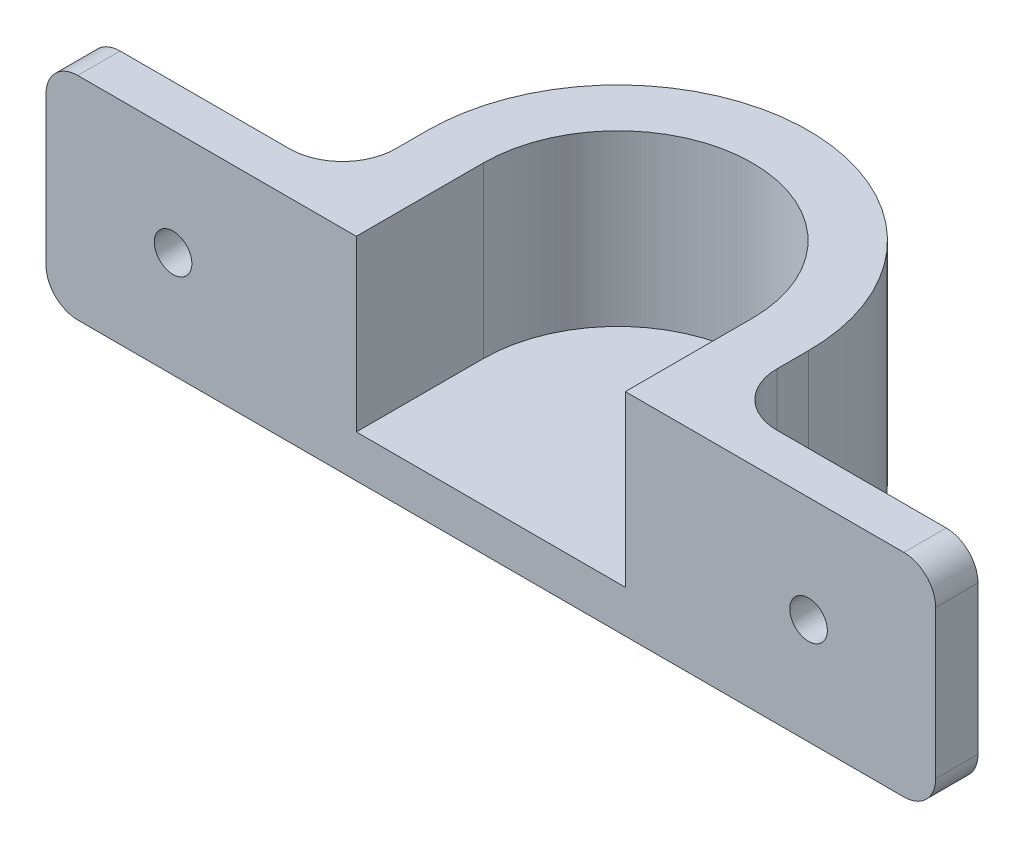
ISO-10303-21;
HEADER;
FILE_DESCRIPTION(('STEP AP214'),'2;1');
FILE_NAME('part.step','',(''),(''),'','','');
FILE_SCHEMA(('AUTOMOTIVE_DESIGN { 1 0 10303 214 1 1 1 1 }'));
ENDSEC;
DATA;
#1=APPLICATION_CONTEXT('core data for automotive mechanical design processes');
#2=APPLICATION_PROTOCOL_DEFINITION('international standard','automotive_design',2000,#1);
#3=PRODUCT_CONTEXT('',#1,'mechanical');
#4=PRODUCT('Part','Part','',(#3));
#5=PRODUCT_RELATED_PRODUCT_CATEGORY('part','',(#4));
#6=PRODUCT_DEFINITION_FORMATION('','',#4);
#7=PRODUCT_DEFINITION_CONTEXT('part definition',#1,'design');
#8=PRODUCT_DEFINITION('design','',#6,#7);
#9=PRODUCT_DEFINITION_SHAPE('','',#8);
#10=(LENGTH_UNIT() NAMED_UNIT(*) SI_UNIT(.MILLI.,.METRE.));
#11=(NAMED_UNIT(*) PLANE_ANGLE_UNIT() SI_UNIT($,.RADIAN.));
#12=(NAMED_UNIT(*) SI_UNIT($,.STERADIAN.) SOLID_ANGLE_UNIT());
#13=UNCERTAINTY_MEASURE_WITH_UNIT(LENGTH_MEASURE(1.E-05),#10,'distance_accuracy_value','');
#14=(GEOMETRIC_REPRESENTATION_CONTEXT(3) GLOBAL_UNCERTAINTY_ASSIGNED_CONTEXT((#13)) GLOBAL_UNIT_ASSIGNED_CONTEXT((#10,
#11,#12)) REPRESENTATION_CONTEXT('',''));
#15=CARTESIAN_POINT('',(0.,0.,0.));
#16=DIRECTION('',(0.,0.,1.));
#17=DIRECTION('',(1.,0.,0.));
#18=AXIS2_PLACEMENT_3D('',#15,#16,#17);
#19=CARTESIAN_POINT('',(29.3,20.,-12.));
#20=DIRECTION('',(-1.,0.,0.));
#21=DIRECTION('',(0.,0.,1.));
#22=AXIS2_PLACEMENT_3D('',#19,#20,#21);
#23=PLANE('',#22);
#24=DIRECTION('',(0.,0.,-1.));
#25=VECTOR('',#24,1.);
#26=CARTESIAN_POINT('',(29.3,4.,0.));
#27=LINE('',#26,#25);
#28=CARTESIAN_POINT('',(29.3,4.,0.));
#29=VERTEX_POINT('',#28);
#30=CARTESIAN_POINT('',(29.3,4.,-12.));
#31=VERTEX_POINT('',#30);
#32=EDGE_CURVE('E65',#29,#31,#27,.T.);
#33=ORIENTED_EDGE('',*,*,#32,.T.);
#34=DIRECTION('',(0.,-1.,0.));
#35=VECTOR('',#34,1.);
#36=CARTESIAN_POINT('',(29.3,20.,-12.));
#37=LINE('',#36,#35);
#38=CARTESIAN_POINT('',(29.3,20.,-12.));
#39=VERTEX_POINT('',#38);
#40=EDGE_CURVE('E180',#39,#31,#37,.T.);
#41=ORIENTED_EDGE('',*,*,#40,.F.);
#42=DIRECTION('',(0.,0.,-1.));
#43=VECTOR('',#42,1.);
#44=CARTESIAN_POINT('',(29.3,20.,-12.));
#45=LINE('',#44,#43);
#46=CARTESIAN_POINT('',(29.3,20.,0.));
#47=VERTEX_POINT('',#46);
#48=EDGE_CURVE('E173',#47,#39,#45,.T.);
#49=ORIENTED_EDGE('',*,*,#48,.F.);
#50=DIRECTION('',(0.,-1.,0.));
#51=VECTOR('',#50,1.);
#52=CARTESIAN_POINT('',(29.3,20.,0.));
#53=LINE('',#52,#51);
#54=EDGE_CURVE('E61',#47,#29,#53,.T.);
#55=ORIENTED_EDGE('',*,*,#54,.T.);
#56=EDGE_LOOP('',(#33,#41,#49,#55));
#57=FACE_BOUND('',#56,.T.);
#58=ADVANCED_FACE('F45',(#57),#23,.F.);
#59=CARTESIAN_POINT('',(42.,20.,-12.));
#60=DIRECTION('',(0.,-1.,0.));
#61=DIRECTION('',(0.,0.,-1.));
#62=AXIS2_PLACEMENT_3D('',#59,#60,#61);
#63=CYLINDRICAL_SURFACE('',#62,12.7);
#64=CARTESIAN_POINT('',(42.,4.,-12.));
#65=DIRECTION('',(0.,-1.,0.));
#66=DIRECTION('',(0.,0.,-1.));
#67=AXIS2_PLACEMENT_3D('',#64,#65,#66);
#68=CIRCLE('',#67,12.7);
#69=CARTESIAN_POINT('',(54.7,4.,-12.));
#70=VERTEX_POINT('',#69);
#71=EDGE_CURVE('E359',#31,#70,#68,.T.);
#72=ORIENTED_EDGE('',*,*,#71,.T.);
#73=DIRECTION('',(0.,-1.,0.));
#74=VECTOR('',#73,1.);
#75=CARTESIAN_POINT('',(54.7,20.,-12.));
#76=LINE('',#75,#74);
#77=CARTESIAN_POINT('',(54.7,20.,-12.));
#78=VERTEX_POINT('',#77);
#79=EDGE_CURVE('E199',#78,#70,#76,.T.);
#80=ORIENTED_EDGE('',*,*,#79,.F.);
#81=CARTESIAN_POINT('',(42.,20.,-12.));
#82=DIRECTION('',(0.,-1.,0.));
#83=DIRECTION('',(0.,0.,1.));
#84=AXIS2_PLACEMENT_3D('',#81,#82,#83);
#85=CIRCLE('',#84,12.7);
#86=EDGE_CURVE('E183',#39,#78,#85,.T.);
#87=ORIENTED_EDGE('',*,*,#86,.F.);
#88=ORIENTED_EDGE('',*,*,#40,.T.);
#89=EDGE_LOOP('',(#72,#80,#87,#88));
#90=FACE_BOUND('',#89,.T.);
#91=ADVANCED_FACE('F451',(#90),#63,.F.);
#92=CARTESIAN_POINT('',(54.7,20.,-12.));
#93=DIRECTION('',(1.,0.,0.));
#94=DIRECTION('',(0.,0.,-1.));
#95=AXIS2_PLACEMENT_3D('',#92,#93,#94);
#96=PLANE('',#95);
#97=DIRECTION('',(0.,0.,1.));
#98=VECTOR('',#97,1.);
#99=CARTESIAN_POINT('',(54.7,4.,0.));
#100=LINE('',#99,#98);
#101=CARTESIAN_POINT('',(54.7,4.,0.));
#102=VERTEX_POINT('',#101);
#103=EDGE_CURVE('E353',#70,#102,#100,.T.);
#104=ORIENTED_EDGE('',*,*,#103,.T.);
#105=DIRECTION('',(0.,-1.,0.));
#106=VECTOR('',#105,1.);
#107=CARTESIAN_POINT('',(54.7,20.,0.));
#108=LINE('',#107,#106);
#109=CARTESIAN_POINT('',(54.7,20.,0.));
#110=VERTEX_POINT('',#109);
#111=EDGE_CURVE('E343',#110,#102,#108,.T.);
#112=ORIENTED_EDGE('',*,*,#111,.F.);
#113=DIRECTION('',(0.,0.,1.));
#114=VECTOR('',#113,1.);
#115=CARTESIAN_POINT('',(54.7,20.,-12.));
#116=LINE('',#115,#114);
#117=EDGE_CURVE('E354',#78,#110,#116,.T.);
#118=ORIENTED_EDGE('',*,*,#117,.F.);
#119=ORIENTED_EDGE('',*,*,#79,.T.);
#120=EDGE_LOOP('',(#104,#112,#118,#119));
#121=FACE_BOUND('',#120,.T.);
#122=ADVANCED_FACE('F351',(#121),#96,.F.);
#123=CARTESIAN_POINT('',(54.7,20.,0.));
#124=DIRECTION('',(0.,0.,-1.));
#125=DIRECTION('',(-1.,0.,0.));
#126=AXIS2_PLACEMENT_3D('',#123,#124,#125);
#127=PLANE('',#126);
#128=CARTESIAN_POINT('',(72.,10.,0.));
#129=DIRECTION('',(0.,0.,-1.));
#130=DIRECTION('',(-1.,0.,0.));
#131=AXIS2_PLACEMENT_3D('',#128,#129,#130);
#132=CIRCLE('',#131,1.775);
#133=CARTESIAN_POINT('',(70.225,10.,0.));
#134=VERTEX_POINT('',#133);
#135=EDGE_CURVE('E315',#134,#134,#132,.T.);
#136=ORIENTED_EDGE('',*,*,#135,.T.);
#137=EDGE_LOOP('',(#136));
#138=FACE_BOUND('',#137,.T.);
#139=DIRECTION('',(1.,0.,0.));
#140=VECTOR('',#139,1.);
#141=CARTESIAN_POINT('',(54.7,0.,0.));
#142=LINE('',#141,#140);
#143=CARTESIAN_POINT('',(3.,0.,0.));
#144=VERTEX_POINT('',#143);
#145=CARTESIAN_POINT('',(81.,0.,0.));
#146=VERTEX_POINT('',#145);
#147=EDGE_CURVE('E311',#144,#146,#142,.T.);
#148=ORIENTED_EDGE('',*,*,#147,.T.);
#149=CARTESIAN_POINT('',(81.,3.,0.));
#150=DIRECTION('',(0.,0.,-1.));
#151=DIRECTION('',(-1.,0.,0.));
#152=AXIS2_PLACEMENT_3D('',#149,#150,#151);
#153=CIRCLE('',#152,3.);
#154=CARTESIAN_POINT('',(84.,3.,0.));
#155=VERTEX_POINT('',#154);
#156=EDGE_CURVE('E249',#146,#155,#153,.F.);
#157=ORIENTED_EDGE('',*,*,#156,.T.);
#158=DIRECTION('',(0.,-1.,0.));
#159=VECTOR('',#158,1.);
#160=CARTESIAN_POINT('',(84.,20.,0.));
#161=LINE('',#160,#159);
#162=CARTESIAN_POINT('',(84.,17.,0.));
#163=VERTEX_POINT('',#162);
#164=EDGE_CURVE('E339',#163,#155,#161,.T.);
#165=ORIENTED_EDGE('',*,*,#164,.F.);
#166=CARTESIAN_POINT('',(81.,17.,0.));
#167=DIRECTION('',(0.,0.,-1.));
#168=DIRECTION('',(-1.,0.,0.));
#169=AXIS2_PLACEMENT_3D('',#166,#167,#168);
#170=CIRCLE('',#169,3.);
#171=CARTESIAN_POINT('',(81.,20.,0.));
#172=VERTEX_POINT('',#171);
#173=EDGE_CURVE('E246',#163,#172,#170,.F.);
#174=ORIENTED_EDGE('',*,*,#173,.T.);
#175=DIRECTION('',(1.,0.,0.));
#176=VECTOR('',#175,1.);
#177=CARTESIAN_POINT('',(54.7,20.,0.));
#178=LINE('',#177,#176);
#179=EDGE_CURVE('E387',#110,#172,#178,.T.);
#180=ORIENTED_EDGE('',*,*,#179,.F.);
#181=ORIENTED_EDGE('',*,*,#111,.T.);
#182=DIRECTION('',(-1.,0.,0.));
#183=VECTOR('',#182,1.);
#184=CARTESIAN_POINT('',(29.3,4.,0.));
#185=LINE('',#184,#183);
#186=EDGE_CURVE('E191',#102,#29,#185,.T.);
#187=ORIENTED_EDGE('',*,*,#186,.T.);
#188=ORIENTED_EDGE('',*,*,#54,.F.);
#189=DIRECTION('',(1.,0.,0.));
#190=VECTOR('',#189,1.);
#191=CARTESIAN_POINT('',(29.3,20.,0.));
#192=LINE('',#191,#190);
#193=CARTESIAN_POINT('',(3.,20.,0.));
#194=VERTEX_POINT('',#193);
#195=EDGE_CURVE('E170',#194,#47,#192,.T.);
#196=ORIENTED_EDGE('',*,*,#195,.F.);
#197=CARTESIAN_POINT('',(3.,17.,0.));
#198=DIRECTION('',(0.,0.,-1.));
#199=DIRECTION('',(-1.,0.,0.));
#200=AXIS2_PLACEMENT_3D('',#197,#198,#199);
#201=CIRCLE('',#200,3.);
#202=CARTESIAN_POINT('',(0.,17.,0.));
#203=VERTEX_POINT('',#202);
#204=EDGE_CURVE('E206',#194,#203,#201,.F.);
#205=ORIENTED_EDGE('',*,*,#204,.T.);
#206=DIRECTION('',(0.,-1.,0.));
#207=VECTOR('',#206,1.);
#208=CARTESIAN_POINT('',(0.,20.,0.));
#209=LINE('',#208,#207);
#210=CARTESIAN_POINT('',(0.,3.,0.));
#211=VERTEX_POINT('',#210);
#212=EDGE_CURVE('E300',#203,#211,#209,.T.);
#213=ORIENTED_EDGE('',*,*,#212,.T.);
#214=CARTESIAN_POINT('',(3.,3.,0.));
#215=DIRECTION('',(0.,0.,-1.));
#216=DIRECTION('',(-1.,0.,0.));
#217=AXIS2_PLACEMENT_3D('',#214,#215,#216);
#218=CIRCLE('',#217,3.);
#219=EDGE_CURVE('E209',#211,#144,#218,.F.);
#220=ORIENTED_EDGE('',*,*,#219,.T.);
#221=EDGE_LOOP('',(#148,#157,#165,#174,#180,#181,#187,#188,#196,#205,#213,#220));
#222=FACE_BOUND('',#221,.T.);
#223=CARTESIAN_POINT('',(12.,10.,0.));
#224=DIRECTION('',(0.,0.,-1.));
#225=DIRECTION('',(-1.,0.,0.));
#226=AXIS2_PLACEMENT_3D('',#223,#224,#225);
#227=CIRCLE('',#226,1.775);
#228=CARTESIAN_POINT('',(10.225,10.,0.));
#229=VERTEX_POINT('',#228);
#230=EDGE_CURVE('E364',#229,#229,#227,.T.);
#231=ORIENTED_EDGE('',*,*,#230,.T.);
#232=EDGE_LOOP('',(#231));
#233=FACE_BOUND('',#232,.T.);
#234=ADVANCED_FACE('F187',(#138,#222,#233),#127,.F.);
#235=CARTESIAN_POINT('',(84.,20.,-4.00000000000001));
#236=DIRECTION('',(-1.,0.,0.));
#237=DIRECTION('',(0.,0.,1.));
#238=AXIS2_PLACEMENT_3D('',#235,#236,#237);
#239=PLANE('',#238);
#240=ORIENTED_EDGE('',*,*,#164,.T.);
#241=DIRECTION('',(0.,0.,-1.));
#242=VECTOR('',#241,1.);
#243=CARTESIAN_POINT('',(84.,3.,-4.00000000000001));
#244=LINE('',#243,#242);
#245=CARTESIAN_POINT('',(84.,3.,-4.00000000000001));
#246=VERTEX_POINT('',#245);
#247=EDGE_CURVE('E236',#155,#246,#244,.T.);
#248=ORIENTED_EDGE('',*,*,#247,.T.);
#249=DIRECTION('',(0.,-1.,0.));
#250=VECTOR('',#249,1.);
#251=CARTESIAN_POINT('',(84.,20.,-4.00000000000001));
#252=LINE('',#251,#250);
#253=CARTESIAN_POINT('',(84.,17.,-4.00000000000001));
#254=VERTEX_POINT('',#253);
#255=EDGE_CURVE('E335',#254,#246,#252,.T.);
#256=ORIENTED_EDGE('',*,*,#255,.F.);
#257=DIRECTION('',(0.,0.,-1.));
#258=VECTOR('',#257,1.);
#259=CARTESIAN_POINT('',(84.,17.,0.));
#260=LINE('',#259,#258);
#261=EDGE_CURVE('E233',#254,#163,#260,.F.);
#262=ORIENTED_EDGE('',*,*,#261,.T.);
#263=EDGE_LOOP('',(#240,#248,#256,#262));
#264=FACE_BOUND('',#263,.T.);
#265=ADVANCED_FACE('F423',(#264),#239,.F.);
#266=CARTESIAN_POINT('',(60.,20.,-4.));
#267=DIRECTION('',(0.,0.,1.));
#268=DIRECTION('',(1.,0.,0.));
#269=AXIS2_PLACEMENT_3D('',#266,#267,#268);
#270=PLANE('',#269);
#271=CARTESIAN_POINT('',(72.,10.,-4.));
#272=DIRECTION('',(0.,0.,-1.));
#273=DIRECTION('',(-1.,0.,0.));
#274=AXIS2_PLACEMENT_3D('',#271,#272,#273);
#275=CIRCLE('',#274,1.775);
#276=CARTESIAN_POINT('',(70.225,10.,-4.));
#277=VERTEX_POINT('',#276);
#278=EDGE_CURVE('E372',#277,#277,#275,.T.);
#279=ORIENTED_EDGE('',*,*,#278,.F.);
#280=EDGE_LOOP('',(#279));
#281=FACE_BOUND('',#280,.T.);
#282=DIRECTION('',(-1.,0.,0.));
#283=VECTOR('',#282,1.);
#284=CARTESIAN_POINT('',(60.,0.,-4.));
#285=LINE('',#284,#283);
#286=CARTESIAN_POINT('',(81.,0.,-4.));
#287=VERTEX_POINT('',#286);
#288=CARTESIAN_POINT('',(65.,0.,-4.));
#289=VERTEX_POINT('',#288);
#290=EDGE_CURVE('E314',#287,#289,#285,.T.);
#291=ORIENTED_EDGE('',*,*,#290,.T.);
#292=DIRECTION('',(0.,-1.,0.));
#293=VECTOR('',#292,1.);
#294=CARTESIAN_POINT('',(65.,20.,-4.));
#295=LINE('',#294,#293);
#296=CARTESIAN_POINT('',(65.,20.,-4.));
#297=VERTEX_POINT('',#296);
#298=EDGE_CURVE('E256',#289,#297,#295,.F.);
#299=ORIENTED_EDGE('',*,*,#298,.T.);
#300=DIRECTION('',(-1.,0.,0.));
#301=VECTOR('',#300,1.);
#302=CARTESIAN_POINT('',(60.,20.,-4.));
#303=LINE('',#302,#301);
#304=CARTESIAN_POINT('',(81.,20.,-4.));
#305=VERTEX_POINT('',#304);
#306=EDGE_CURVE('E391',#305,#297,#303,.T.);
#307=ORIENTED_EDGE('',*,*,#306,.F.);
#308=CARTESIAN_POINT('',(81.,17.,-4.00000000000001));
#309=DIRECTION('',(0.,0.,1.));
#310=DIRECTION('',(1.,0.,0.));
#311=AXIS2_PLACEMENT_3D('',#308,#309,#310);
#312=CIRCLE('',#311,3.);
#313=EDGE_CURVE('E240',#305,#254,#312,.F.);
#314=ORIENTED_EDGE('',*,*,#313,.T.);
#315=ORIENTED_EDGE('',*,*,#255,.T.);
#316=CARTESIAN_POINT('',(81.,3.,-4.));
#317=DIRECTION('',(0.,0.,1.));
#318=DIRECTION('',(1.,0.,0.));
#319=AXIS2_PLACEMENT_3D('',#316,#317,#318);
#320=CIRCLE('',#319,3.);
#321=EDGE_CURVE('E243',#246,#287,#320,.F.);
#322=ORIENTED_EDGE('',*,*,#321,.T.);
#323=EDGE_LOOP('',(#291,#299,#307,#314,#315,#322));
#324=FACE_BOUND('',#323,.T.);
#325=ADVANCED_FACE('F414',(#281,#324),#270,.F.);
#326=CARTESIAN_POINT('',(60.,20.,-12.));
#327=DIRECTION('',(-1.,0.,0.));
#328=DIRECTION('',(0.,0.,1.));
#329=AXIS2_PLACEMENT_3D('',#326,#327,#328);
#330=PLANE('',#329);
#331=DIRECTION('',(0.,0.,-1.));
#332=VECTOR('',#331,1.);
#333=CARTESIAN_POINT('',(60.,20.,-12.));
#334=LINE('',#333,#332);
#335=CARTESIAN_POINT('',(60.,20.,-9.));
#336=VERTEX_POINT('',#335);
#337=CARTESIAN_POINT('',(60.,20.,-12.));
#338=VERTEX_POINT('',#337);
#339=EDGE_CURVE('E395',#336,#338,#334,.T.);
#340=ORIENTED_EDGE('',*,*,#339,.F.);
#341=DIRECTION('',(0.,-1.,0.));
#342=VECTOR('',#341,1.);
#343=CARTESIAN_POINT('',(60.,0.,-9.));
#344=LINE('',#343,#342);
#345=CARTESIAN_POINT('',(60.,0.,-9.));
#346=VERTEX_POINT('',#345);
#347=EDGE_CURVE('E252',#336,#346,#344,.T.);
#348=ORIENTED_EDGE('',*,*,#347,.T.);
#349=DIRECTION('',(0.,0.,-1.));
#350=VECTOR('',#349,1.);
#351=CARTESIAN_POINT('',(60.,0.,-12.));
#352=LINE('',#351,#350);
#353=CARTESIAN_POINT('',(60.,0.,-12.));
#354=VERTEX_POINT('',#353);
#355=EDGE_CURVE('E319',#346,#354,#352,.T.);
#356=ORIENTED_EDGE('',*,*,#355,.T.);
#357=DIRECTION('',(0.,-1.,0.));
#358=VECTOR('',#357,1.);
#359=CARTESIAN_POINT('',(60.,20.,-12.));
#360=LINE('',#359,#358);
#361=EDGE_CURVE('E331',#338,#354,#360,.T.);
#362=ORIENTED_EDGE('',*,*,#361,.F.);
#363=EDGE_LOOP('',(#340,#348,#356,#362));
#364=FACE_BOUND('',#363,.T.);
#365=ADVANCED_FACE('F406',(#364),#330,.F.);
#366=CARTESIAN_POINT('',(42.,20.,-12.));
#367=DIRECTION('',(0.,-1.,0.));
#368=DIRECTION('',(0.,0.,-1.));
#369=AXIS2_PLACEMENT_3D('',#366,#367,#368);
#370=CYLINDRICAL_SURFACE('',#369,18.);
#371=CARTESIAN_POINT('',(42.,0.,-12.));
#372=DIRECTION('',(0.,1.,0.));
#373=DIRECTION('',(0.,0.,1.));
#374=AXIS2_PLACEMENT_3D('',#371,#372,#373);
#375=CIRCLE('',#374,18.);
#376=CARTESIAN_POINT('',(24.,0.,-12.));
#377=VERTEX_POINT('',#376);
#378=EDGE_CURVE('E289',#354,#377,#375,.T.);
#379=ORIENTED_EDGE('',*,*,#378,.T.);
#380=DIRECTION('',(0.,-1.,0.));
#381=VECTOR('',#380,1.);
#382=CARTESIAN_POINT('',(24.,20.,-12.));
#383=LINE('',#382,#381);
#384=CARTESIAN_POINT('',(24.,20.,-12.));
#385=VERTEX_POINT('',#384);
#386=EDGE_CURVE('E287',#385,#377,#383,.T.);
#387=ORIENTED_EDGE('',*,*,#386,.F.);
#388=CARTESIAN_POINT('',(42.,20.,-12.));
#389=DIRECTION('',(0.,1.,0.));
#390=DIRECTION('',(0.,0.,1.));
#391=AXIS2_PLACEMENT_3D('',#388,#389,#390);
#392=CIRCLE('',#391,18.);
#393=EDGE_CURVE('E307',#338,#385,#392,.T.);
#394=ORIENTED_EDGE('',*,*,#393,.F.);
#395=ORIENTED_EDGE('',*,*,#361,.T.);
#396=EDGE_LOOP('',(#379,#387,#394,#395));
#397=FACE_BOUND('',#396,.T.);
#398=ADVANCED_FACE('F402',(#397),#370,.T.);
#399=CARTESIAN_POINT('',(24.,20.,-12.));
#400=DIRECTION('',(1.,0.,0.));
#401=DIRECTION('',(0.,0.,-1.));
#402=AXIS2_PLACEMENT_3D('',#399,#400,#401);
#403=PLANE('',#402);
#404=DIRECTION('',(0.,0.,1.));
#405=VECTOR('',#404,1.);
#406=CARTESIAN_POINT('',(24.,0.,-12.));
#407=LINE('',#406,#405);
#408=CARTESIAN_POINT('',(24.,0.,-9.00000000000001));
#409=VERTEX_POINT('',#408);
#410=EDGE_CURVE('E278',#377,#409,#407,.T.);
#411=ORIENTED_EDGE('',*,*,#410,.T.);
#412=DIRECTION('',(0.,-1.,0.));
#413=VECTOR('',#412,1.);
#414=CARTESIAN_POINT('',(24.,20.,-9.00000000000001));
#415=LINE('',#414,#413);
#416=CARTESIAN_POINT('',(24.,20.,-9.00000000000001));
#417=VERTEX_POINT('',#416);
#418=EDGE_CURVE('E263',#409,#417,#415,.F.);
#419=ORIENTED_EDGE('',*,*,#418,.T.);
#420=DIRECTION('',(0.,0.,1.));
#421=VECTOR('',#420,1.);
#422=CARTESIAN_POINT('',(24.,20.,-12.));
#423=LINE('',#422,#421);
#424=EDGE_CURVE('E294',#385,#417,#423,.T.);
#425=ORIENTED_EDGE('',*,*,#424,.F.);
#426=ORIENTED_EDGE('',*,*,#386,.T.);
#427=EDGE_LOOP('',(#411,#419,#425,#426));
#428=FACE_BOUND('',#427,.T.);
#429=ADVANCED_FACE('F284',(#428),#403,.F.);
#430=CARTESIAN_POINT('',(0.,20.,-4.));
#431=DIRECTION('',(0.,0.,1.));
#432=DIRECTION('',(1.,0.,0.));
#433=AXIS2_PLACEMENT_3D('',#430,#431,#432);
#434=PLANE('',#433);
#435=CARTESIAN_POINT('',(12.,10.,-4.));
#436=DIRECTION('',(0.,0.,-1.));
#437=DIRECTION('',(-1.,0.,0.));
#438=AXIS2_PLACEMENT_3D('',#435,#436,#437);
#439=CIRCLE('',#438,1.775);
#440=CARTESIAN_POINT('',(10.225,10.,-4.));
#441=VERTEX_POINT('',#440);
#442=EDGE_CURVE('E376',#441,#441,#439,.T.);
#443=ORIENTED_EDGE('',*,*,#442,.F.);
#444=EDGE_LOOP('',(#443));
#445=FACE_BOUND('',#444,.T.);
#446=DIRECTION('',(-1.,0.,0.));
#447=VECTOR('',#446,1.);
#448=CARTESIAN_POINT('',(0.,20.,-4.));
#449=LINE('',#448,#447);
#450=CARTESIAN_POINT('',(19.,20.,-4.));
#451=VERTEX_POINT('',#450);
#452=CARTESIAN_POINT('',(3.,20.,-4.));
#453=VERTEX_POINT('',#452);
#454=EDGE_CURVE('E293',#451,#453,#449,.T.);
#455=ORIENTED_EDGE('',*,*,#454,.F.);
#456=DIRECTION('',(0.,-1.,0.));
#457=VECTOR('',#456,1.);
#458=CARTESIAN_POINT('',(19.,0.,-4.));
#459=LINE('',#458,#457);
#460=CARTESIAN_POINT('',(19.,0.,-4.));
#461=VERTEX_POINT('',#460);
#462=EDGE_CURVE('E259',#451,#461,#459,.T.);
#463=ORIENTED_EDGE('',*,*,#462,.T.);
#464=DIRECTION('',(-1.,0.,0.));
#465=VECTOR('',#464,1.);
#466=CARTESIAN_POINT('',(0.,0.,-4.));
#467=LINE('',#466,#465);
#468=CARTESIAN_POINT('',(3.,0.,-4.));
#469=VERTEX_POINT('',#468);
#470=EDGE_CURVE('E178',#461,#469,#467,.T.);
#471=ORIENTED_EDGE('',*,*,#470,.T.);
#472=CARTESIAN_POINT('',(3.,3.,-4.));
#473=DIRECTION('',(0.,0.,1.));
#474=DIRECTION('',(1.,0.,0.));
#475=AXIS2_PLACEMENT_3D('',#472,#473,#474);
#476=CIRCLE('',#475,3.);
#477=CARTESIAN_POINT('',(0.,3.,-4.));
#478=VERTEX_POINT('',#477);
#479=EDGE_CURVE('E224',#469,#478,#476,.F.);
#480=ORIENTED_EDGE('',*,*,#479,.T.);
#481=DIRECTION('',(0.,-1.,0.));
#482=VECTOR('',#481,1.);
#483=CARTESIAN_POINT('',(0.,20.,-4.));
#484=LINE('',#483,#482);
#485=CARTESIAN_POINT('',(0.,17.,-4.));
#486=VERTEX_POINT('',#485);
#487=EDGE_CURVE('E305',#486,#478,#484,.T.);
#488=ORIENTED_EDGE('',*,*,#487,.F.);
#489=CARTESIAN_POINT('',(3.,17.,-4.));
#490=DIRECTION('',(0.,0.,1.));
#491=DIRECTION('',(1.,0.,0.));
#492=AXIS2_PLACEMENT_3D('',#489,#490,#491);
#493=CIRCLE('',#492,3.);
#494=EDGE_CURVE('E220',#486,#453,#493,.F.);
#495=ORIENTED_EDGE('',*,*,#494,.T.);
#496=EDGE_LOOP('',(#455,#463,#471,#480,#488,#495));
#497=FACE_BOUND('',#496,.T.);
#498=ADVANCED_FACE('F296',(#445,#497),#434,.F.);
#499=CARTESIAN_POINT('',(0.,20.,0.));
#500=DIRECTION('',(1.,0.,0.));
#501=DIRECTION('',(0.,0.,-1.));
#502=AXIS2_PLACEMENT_3D('',#499,#500,#501);
#503=PLANE('',#502);
#504=ORIENTED_EDGE('',*,*,#487,.T.);
#505=DIRECTION('',(0.,0.,1.));
#506=VECTOR('',#505,1.);
#507=CARTESIAN_POINT('',(0.,3.,0.));
#508=LINE('',#507,#506);
#509=EDGE_CURVE('E197',#478,#211,#508,.T.);
#510=ORIENTED_EDGE('',*,*,#509,.T.);
#511=ORIENTED_EDGE('',*,*,#212,.F.);
#512=DIRECTION('',(0.,0.,1.));
#513=VECTOR('',#512,1.);
#514=CARTESIAN_POINT('',(0.,17.,-4.));
#515=LINE('',#514,#513);
#516=EDGE_CURVE('E193',#203,#486,#515,.F.);
#517=ORIENTED_EDGE('',*,*,#516,.T.);
#518=EDGE_LOOP('',(#504,#510,#511,#517));
#519=FACE_BOUND('',#518,.T.);
#520=ADVANCED_FACE('F437',(#519),#503,.F.);
#521=CARTESIAN_POINT('',(42.,20.,-12.));
#522=DIRECTION('',(0.,1.,0.));
#523=DIRECTION('',(0.,0.,1.));
#524=AXIS2_PLACEMENT_3D('',#521,#522,#523);
#525=PLANE('',#524);
#526=ORIENTED_EDGE('',*,*,#424,.T.);
#527=CARTESIAN_POINT('',(19.,20.,-9.));
#528=DIRECTION('',(0.,1.,0.));
#529=DIRECTION('',(0.,0.,1.));
#530=AXIS2_PLACEMENT_3D('',#527,#528,#529);
#531=CIRCLE('',#530,5.);
#532=EDGE_CURVE('E11',#417,#451,#531,.F.);
#533=ORIENTED_EDGE('',*,*,#532,.T.);
#534=ORIENTED_EDGE('',*,*,#454,.T.);
#535=DIRECTION('',(0.,0.,1.));
#536=VECTOR('',#535,1.);
#537=CARTESIAN_POINT('',(3.,20.,0.));
#538=LINE('',#537,#536);
#539=EDGE_CURVE('E175',#453,#194,#538,.T.);
#540=ORIENTED_EDGE('',*,*,#539,.T.);
#541=ORIENTED_EDGE('',*,*,#195,.T.);
#542=ORIENTED_EDGE('',*,*,#48,.T.);
#543=ORIENTED_EDGE('',*,*,#86,.T.);
#544=ORIENTED_EDGE('',*,*,#117,.T.);
#545=ORIENTED_EDGE('',*,*,#179,.T.);
#546=DIRECTION('',(0.,0.,-1.));
#547=VECTOR('',#546,1.);
#548=CARTESIAN_POINT('',(81.,20.,-4.00000000000001));
#549=LINE('',#548,#547);
#550=EDGE_CURVE('E227',#172,#305,#549,.T.);
#551=ORIENTED_EDGE('',*,*,#550,.T.);
#552=ORIENTED_EDGE('',*,*,#306,.T.);
#553=CARTESIAN_POINT('',(65.,20.,-9.));
#554=DIRECTION('',(0.,1.,0.));
#555=DIRECTION('',(0.,0.,1.));
#556=AXIS2_PLACEMENT_3D('',#553,#554,#555);
#557=CIRCLE('',#556,5.);
#558=EDGE_CURVE('E269',#297,#336,#557,.F.);
#559=ORIENTED_EDGE('',*,*,#558,.T.);
#560=ORIENTED_EDGE('',*,*,#339,.T.);
#561=ORIENTED_EDGE('',*,*,#393,.T.);
#562=EDGE_LOOP('',(#526,#533,#534,#540,#541,#542,#543,#544,#545,#551,#552,#559,#560,#561));
#563=FACE_BOUND('',#562,.T.);
#564=ADVANCED_FACE('F172',(#563),#525,.T.);
#565=CARTESIAN_POINT('',(42.,0.,-12.));
#566=DIRECTION('',(0.,1.,0.));
#567=DIRECTION('',(0.,0.,1.));
#568=AXIS2_PLACEMENT_3D('',#565,#566,#567);
#569=PLANE('',#568);
#570=ORIENTED_EDGE('',*,*,#147,.F.);
#571=DIRECTION('',(0.,0.,1.));
#572=VECTOR('',#571,1.);
#573=CARTESIAN_POINT('',(3.,0.,-12.));
#574=LINE('',#573,#572);
#575=EDGE_CURVE('E216',#144,#469,#574,.F.);
#576=ORIENTED_EDGE('',*,*,#575,.T.);
#577=ORIENTED_EDGE('',*,*,#470,.F.);
#578=CARTESIAN_POINT('',(19.,0.,-9.));
#579=DIRECTION('',(0.,1.,0.));
#580=DIRECTION('',(0.,0.,1.));
#581=AXIS2_PLACEMENT_3D('',#578,#579,#580);
#582=CIRCLE('',#581,5.);
#583=EDGE_CURVE('E54',#461,#409,#582,.T.);
#584=ORIENTED_EDGE('',*,*,#583,.T.);
#585=ORIENTED_EDGE('',*,*,#410,.F.);
#586=ORIENTED_EDGE('',*,*,#378,.F.);
#587=ORIENTED_EDGE('',*,*,#355,.F.);
#588=CARTESIAN_POINT('',(65.,0.,-9.));
#589=DIRECTION('',(0.,1.,0.));
#590=DIRECTION('',(0.,0.,1.));
#591=AXIS2_PLACEMENT_3D('',#588,#589,#590);
#592=CIRCLE('',#591,5.);
#593=EDGE_CURVE('E266',#346,#289,#592,.T.);
#594=ORIENTED_EDGE('',*,*,#593,.T.);
#595=ORIENTED_EDGE('',*,*,#290,.F.);
#596=DIRECTION('',(0.,0.,-1.));
#597=VECTOR('',#596,1.);
#598=CARTESIAN_POINT('',(81.,0.,-12.));
#599=LINE('',#598,#597);
#600=EDGE_CURVE('E213',#287,#146,#599,.F.);
#601=ORIENTED_EDGE('',*,*,#600,.T.);
#602=EDGE_LOOP('',(#570,#576,#577,#584,#585,#586,#587,#594,#595,#601));
#603=FACE_BOUND('',#602,.T.);
#604=ADVANCED_FACE('F276',(#603),#569,.F.);
#605=CARTESIAN_POINT('',(12.,10.,0.));
#606=DIRECTION('',(0.,0.,-1.));
#607=DIRECTION('',(-1.,0.,0.));
#608=AXIS2_PLACEMENT_3D('',#605,#606,#607);
#609=CYLINDRICAL_SURFACE('',#608,1.775);
#610=ORIENTED_EDGE('',*,*,#230,.F.);
#611=EDGE_LOOP('',(#610));
#612=FACE_BOUND('',#611,.T.);
#613=ORIENTED_EDGE('',*,*,#442,.T.);
#614=EDGE_LOOP('',(#613));
#615=FACE_BOUND('',#614,.T.);
#616=ADVANCED_FACE('F482',(#612,#615),#609,.F.);
#617=CARTESIAN_POINT('',(72.,10.,0.));
#618=DIRECTION('',(0.,0.,-1.));
#619=DIRECTION('',(-1.,0.,0.));
#620=AXIS2_PLACEMENT_3D('',#617,#618,#619);
#621=CYLINDRICAL_SURFACE('',#620,1.775);
#622=ORIENTED_EDGE('',*,*,#135,.F.);
#623=EDGE_LOOP('',(#622));
#624=FACE_BOUND('',#623,.T.);
#625=ORIENTED_EDGE('',*,*,#278,.T.);
#626=EDGE_LOOP('',(#625));
#627=FACE_BOUND('',#626,.T.);
#628=ADVANCED_FACE('F448',(#624,#627),#621,.F.);
#629=CARTESIAN_POINT('',(3.,3.,0.));
#630=DIRECTION('',(0.,0.,1.));
#631=DIRECTION('',(1.,0.,0.));
#632=AXIS2_PLACEMENT_3D('',#629,#630,#631);
#633=CYLINDRICAL_SURFACE('',#632,3.);
#634=ORIENTED_EDGE('',*,*,#479,.F.);
#635=ORIENTED_EDGE('',*,*,#575,.F.);
#636=ORIENTED_EDGE('',*,*,#219,.F.);
#637=ORIENTED_EDGE('',*,*,#509,.F.);
#638=EDGE_LOOP('',(#634,#635,#636,#637));
#639=FACE_BOUND('',#638,.T.);
#640=ADVANCED_FACE('F435',(#639),#633,.T.);
#641=CARTESIAN_POINT('',(3.,17.,-12.));
#642=DIRECTION('',(0.,0.,-1.));
#643=DIRECTION('',(-1.,0.,0.));
#644=AXIS2_PLACEMENT_3D('',#641,#642,#643);
#645=CYLINDRICAL_SURFACE('',#644,3.);
#646=ORIENTED_EDGE('',*,*,#494,.F.);
#647=ORIENTED_EDGE('',*,*,#516,.F.);
#648=ORIENTED_EDGE('',*,*,#204,.F.);
#649=ORIENTED_EDGE('',*,*,#539,.F.);
#650=EDGE_LOOP('',(#646,#647,#648,#649));
#651=FACE_BOUND('',#650,.T.);
#652=ADVANCED_FACE('F440',(#651),#645,.T.);
#653=CARTESIAN_POINT('',(81.,3.,-4.00000000000001));
#654=DIRECTION('',(0.,0.,-1.));
#655=DIRECTION('',(-1.,0.,0.));
#656=AXIS2_PLACEMENT_3D('',#653,#654,#655);
#657=CYLINDRICAL_SURFACE('',#656,3.);
#658=ORIENTED_EDGE('',*,*,#156,.F.);
#659=ORIENTED_EDGE('',*,*,#600,.F.);
#660=ORIENTED_EDGE('',*,*,#321,.F.);
#661=ORIENTED_EDGE('',*,*,#247,.F.);
#662=EDGE_LOOP('',(#658,#659,#660,#661));
#663=FACE_BOUND('',#662,.T.);
#664=ADVANCED_FACE('F428',(#663),#657,.T.);
#665=CARTESIAN_POINT('',(81.,17.,-12.));
#666=DIRECTION('',(0.,0.,1.));
#667=DIRECTION('',(1.,0.,0.));
#668=AXIS2_PLACEMENT_3D('',#665,#666,#667);
#669=CYLINDRICAL_SURFACE('',#668,3.);
#670=ORIENTED_EDGE('',*,*,#173,.F.);
#671=ORIENTED_EDGE('',*,*,#261,.F.);
#672=ORIENTED_EDGE('',*,*,#313,.F.);
#673=ORIENTED_EDGE('',*,*,#550,.F.);
#674=EDGE_LOOP('',(#670,#671,#672,#673));
#675=FACE_BOUND('',#674,.T.);
#676=ADVANCED_FACE('F419',(#675),#669,.T.);
#677=CARTESIAN_POINT('',(65.,20.,-9.));
#678=DIRECTION('',(0.,1.,0.));
#679=DIRECTION('',(0.,0.,1.));
#680=AXIS2_PLACEMENT_3D('',#677,#678,#679);
#681=CYLINDRICAL_SURFACE('',#680,5.);
#682=ORIENTED_EDGE('',*,*,#558,.F.);
#683=ORIENTED_EDGE('',*,*,#298,.F.);
#684=ORIENTED_EDGE('',*,*,#593,.F.);
#685=ORIENTED_EDGE('',*,*,#347,.F.);
#686=EDGE_LOOP('',(#682,#683,#684,#685));
#687=FACE_BOUND('',#686,.T.);
#688=ADVANCED_FACE('F410',(#687),#681,.F.);
#689=CARTESIAN_POINT('',(19.,20.,-9.));
#690=DIRECTION('',(0.,1.,0.));
#691=DIRECTION('',(0.,0.,1.));
#692=AXIS2_PLACEMENT_3D('',#689,#690,#691);
#693=CYLINDRICAL_SURFACE('',#692,5.);
#694=ORIENTED_EDGE('',*,*,#532,.F.);
#695=ORIENTED_EDGE('',*,*,#418,.F.);
#696=ORIENTED_EDGE('',*,*,#583,.F.);
#697=ORIENTED_EDGE('',*,*,#462,.F.);
#698=EDGE_LOOP('',(#694,#695,#696,#697));
#699=FACE_BOUND('',#698,.T.);
#700=ADVANCED_FACE('F47',(#699),#693,.F.);
#701=CARTESIAN_POINT('',(42.,4.,-12.));
#702=DIRECTION('',(0.,-1.,0.));
#703=DIRECTION('',(0.,0.,-1.));
#704=AXIS2_PLACEMENT_3D('',#701,#702,#703);
#705=PLANE('',#704);
#706=ORIENTED_EDGE('',*,*,#32,.F.);
#707=ORIENTED_EDGE('',*,*,#186,.F.);
#708=ORIENTED_EDGE('',*,*,#103,.F.);
#709=ORIENTED_EDGE('',*,*,#71,.F.);
#710=EDGE_LOOP('',(#706,#707,#708,#709));
#711=FACE_BOUND('',#710,.T.);
#712=ADVANCED_FACE('F358',(#711),#705,.F.);
#713=CLOSED_SHELL('',(#58,#91,#122,#234,#265,#325,#365,#398,#429,#498,#520,#564,#604,#616,#628,
#640,#652,#664,#676,#688,#700,#712));
#714=MANIFOLD_SOLID_BREP('B2',#713);
#715=ADVANCED_BREP_SHAPE_REPRESENTATION('',(#18,#714),#14);
#716=SHAPE_DEFINITION_REPRESENTATION(#9,#715);
ENDSEC;
END-ISO-10303-21;
